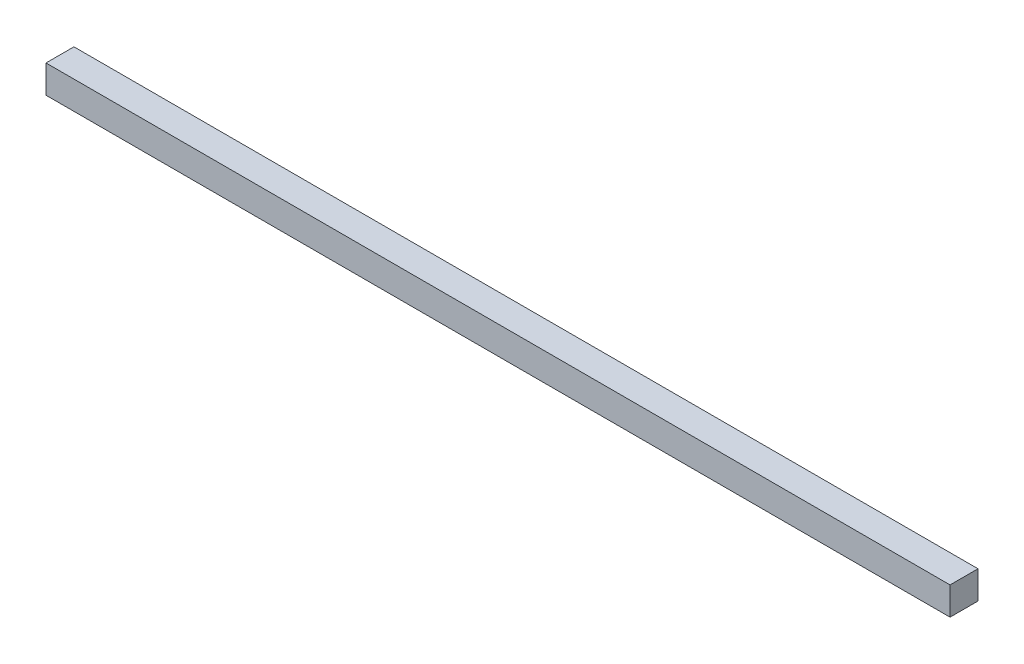
ISO-10303-21;
HEADER;
FILE_DESCRIPTION(('STEP AP214'),'2;1');
FILE_NAME('part.step','',(''),(''),'','','');
FILE_SCHEMA(('AUTOMOTIVE_DESIGN { 1 0 10303 214 1 1 1 1 }'));
ENDSEC;
DATA;
#1=APPLICATION_CONTEXT('core data for automotive mechanical design processes');
#2=APPLICATION_PROTOCOL_DEFINITION('international standard','automotive_design',2000,#1);
#3=PRODUCT_CONTEXT('',#1,'mechanical');
#4=PRODUCT('Part','Part','',(#3));
#5=PRODUCT_RELATED_PRODUCT_CATEGORY('part','',(#4));
#6=PRODUCT_DEFINITION_FORMATION('','',#4);
#7=PRODUCT_DEFINITION_CONTEXT('part definition',#1,'design');
#8=PRODUCT_DEFINITION('design','',#6,#7);
#9=PRODUCT_DEFINITION_SHAPE('','',#8);
#10=(LENGTH_UNIT() NAMED_UNIT(*) SI_UNIT(.MILLI.,.METRE.));
#11=(NAMED_UNIT(*) PLANE_ANGLE_UNIT() SI_UNIT($,.RADIAN.));
#12=(NAMED_UNIT(*) SI_UNIT($,.STERADIAN.) SOLID_ANGLE_UNIT());
#13=UNCERTAINTY_MEASURE_WITH_UNIT(LENGTH_MEASURE(1.E-05),#10,'distance_accuracy_value','');
#14=(GEOMETRIC_REPRESENTATION_CONTEXT(3) GLOBAL_UNCERTAINTY_ASSIGNED_CONTEXT((#13)) GLOBAL_UNIT_ASSIGNED_CONTEXT((#10,
#11,#12)) REPRESENTATION_CONTEXT('',''));
#15=CARTESIAN_POINT('',(0.,0.,0.));
#16=DIRECTION('',(0.,0.,1.));
#17=DIRECTION('',(1.,0.,0.));
#18=AXIS2_PLACEMENT_3D('',#15,#16,#17);
#19=CARTESIAN_POINT('',(-307.975,0.,0.));
#20=DIRECTION('',(0.,-1.,0.));
#21=DIRECTION('',(0.,0.,1.));
#22=AXIS2_PLACEMENT_3D('',#19,#20,#21);
#23=PLANE('',#22);
#24=DIRECTION('',(0.,0.,1.));
#25=VECTOR('',#24,1.);
#26=CARTESIAN_POINT('',(0.,0.,0.));
#27=LINE('',#26,#25);
#28=CARTESIAN_POINT('',(0.,0.,0.));
#29=VERTEX_POINT('',#28);
#30=CARTESIAN_POINT('',(0.,0.,9.525));
#31=VERTEX_POINT('',#30);
#32=EDGE_CURVE('E105',#29,#31,#27,.T.);
#33=ORIENTED_EDGE('',*,*,#32,.T.);
#34=DIRECTION('',(1.,0.,0.));
#35=VECTOR('',#34,1.);
#36=CARTESIAN_POINT('',(-307.975,0.,9.525));
#37=LINE('',#36,#35);
#38=CARTESIAN_POINT('',(-307.975,0.,9.525));
#39=VERTEX_POINT('',#38);
#40=EDGE_CURVE('E44',#39,#31,#37,.T.);
#41=ORIENTED_EDGE('',*,*,#40,.F.);
#42=DIRECTION('',(0.,0.,1.));
#43=VECTOR('',#42,1.);
#44=CARTESIAN_POINT('',(-307.975,0.,0.));
#45=LINE('',#44,#43);
#46=CARTESIAN_POINT('',(-307.975,0.,0.));
#47=VERTEX_POINT('',#46);
#48=EDGE_CURVE('E94',#47,#39,#45,.T.);
#49=ORIENTED_EDGE('',*,*,#48,.F.);
#50=DIRECTION('',(1.,0.,0.));
#51=VECTOR('',#50,1.);
#52=CARTESIAN_POINT('',(-307.975,0.,0.));
#53=LINE('',#52,#51);
#54=EDGE_CURVE('E11',#47,#29,#53,.T.);
#55=ORIENTED_EDGE('',*,*,#54,.T.);
#56=EDGE_LOOP('',(#33,#41,#49,#55));
#57=FACE_BOUND('',#56,.T.);
#58=ADVANCED_FACE('F41',(#57),#23,.T.);
#59=CARTESIAN_POINT('',(-307.975,0.,0.));
#60=DIRECTION('',(0.,0.,1.));
#61=DIRECTION('',(-1.,0.,0.));
#62=AXIS2_PLACEMENT_3D('',#59,#60,#61);
#63=PLANE('',#62);
#64=DIRECTION('',(0.,1.,0.));
#65=VECTOR('',#64,1.);
#66=CARTESIAN_POINT('',(0.,0.,0.));
#67=LINE('',#66,#65);
#68=CARTESIAN_POINT('',(0.,9.525,0.));
#69=VERTEX_POINT('',#68);
#70=EDGE_CURVE('E82',#29,#69,#67,.T.);
#71=ORIENTED_EDGE('',*,*,#70,.F.);
#72=ORIENTED_EDGE('',*,*,#54,.F.);
#73=DIRECTION('',(0.,1.,0.));
#74=VECTOR('',#73,1.);
#75=CARTESIAN_POINT('',(-307.975,0.,0.));
#76=LINE('',#75,#74);
#77=CARTESIAN_POINT('',(-307.975,9.525,0.));
#78=VERTEX_POINT('',#77);
#79=EDGE_CURVE('E59',#47,#78,#76,.T.);
#80=ORIENTED_EDGE('',*,*,#79,.T.);
#81=DIRECTION('',(1.,0.,0.));
#82=VECTOR('',#81,1.);
#83=CARTESIAN_POINT('',(-307.975,9.525,0.));
#84=LINE('',#83,#82);
#85=EDGE_CURVE('E50',#78,#69,#84,.T.);
#86=ORIENTED_EDGE('',*,*,#85,.T.);
#87=EDGE_LOOP('',(#71,#72,#80,#86));
#88=FACE_BOUND('',#87,.T.);
#89=ADVANCED_FACE('F111',(#88),#63,.F.);
#90=CARTESIAN_POINT('',(-307.975,9.525,0.));
#91=DIRECTION('',(0.,-1.,0.));
#92=DIRECTION('',(0.,0.,1.));
#93=AXIS2_PLACEMENT_3D('',#90,#91,#92);
#94=PLANE('',#93);
#95=DIRECTION('',(0.,0.,1.));
#96=VECTOR('',#95,1.);
#97=CARTESIAN_POINT('',(0.,9.525,0.));
#98=LINE('',#97,#96);
#99=CARTESIAN_POINT('',(0.,9.525,9.525));
#100=VERTEX_POINT('',#99);
#101=EDGE_CURVE('E76',#69,#100,#98,.T.);
#102=ORIENTED_EDGE('',*,*,#101,.F.);
#103=ORIENTED_EDGE('',*,*,#85,.F.);
#104=DIRECTION('',(0.,0.,1.));
#105=VECTOR('',#104,1.);
#106=CARTESIAN_POINT('',(-307.975,9.525,0.));
#107=LINE('',#106,#105);
#108=CARTESIAN_POINT('',(-307.975,9.525,9.525));
#109=VERTEX_POINT('',#108);
#110=EDGE_CURVE('E92',#78,#109,#107,.T.);
#111=ORIENTED_EDGE('',*,*,#110,.T.);
#112=DIRECTION('',(1.,0.,0.));
#113=VECTOR('',#112,1.);
#114=CARTESIAN_POINT('',(-307.975,9.525,9.525));
#115=LINE('',#114,#113);
#116=EDGE_CURVE('E97',#109,#100,#115,.T.);
#117=ORIENTED_EDGE('',*,*,#116,.T.);
#118=EDGE_LOOP('',(#102,#103,#111,#117));
#119=FACE_BOUND('',#118,.T.);
#120=ADVANCED_FACE('F100',(#119),#94,.F.);
#121=CARTESIAN_POINT('',(-307.975,0.,9.525));
#122=DIRECTION('',(0.,0.,1.));
#123=DIRECTION('',(-1.,0.,0.));
#124=AXIS2_PLACEMENT_3D('',#121,#122,#123);
#125=PLANE('',#124);
#126=DIRECTION('',(0.,1.,0.));
#127=VECTOR('',#126,1.);
#128=CARTESIAN_POINT('',(0.,0.,9.525));
#129=LINE('',#128,#127);
#130=EDGE_CURVE('E99',#31,#100,#129,.T.);
#131=ORIENTED_EDGE('',*,*,#130,.T.);
#132=ORIENTED_EDGE('',*,*,#116,.F.);
#133=DIRECTION('',(0.,1.,0.));
#134=VECTOR('',#133,1.);
#135=CARTESIAN_POINT('',(-307.975,0.,9.525));
#136=LINE('',#135,#134);
#137=EDGE_CURVE('E89',#39,#109,#136,.T.);
#138=ORIENTED_EDGE('',*,*,#137,.F.);
#139=ORIENTED_EDGE('',*,*,#40,.T.);
#140=EDGE_LOOP('',(#131,#132,#138,#139));
#141=FACE_BOUND('',#140,.T.);
#142=ADVANCED_FACE('F98',(#141),#125,.T.);
#143=CARTESIAN_POINT('',(-307.975,0.,0.));
#144=DIRECTION('',(1.,0.,0.));
#145=DIRECTION('',(0.,0.,1.));
#146=AXIS2_PLACEMENT_3D('',#143,#144,#145);
#147=PLANE('',#146);
#148=ORIENTED_EDGE('',*,*,#48,.T.);
#149=ORIENTED_EDGE('',*,*,#137,.T.);
#150=ORIENTED_EDGE('',*,*,#110,.F.);
#151=ORIENTED_EDGE('',*,*,#79,.F.);
#152=EDGE_LOOP('',(#148,#149,#150,#151));
#153=FACE_BOUND('',#152,.T.);
#154=ADVANCED_FACE('F90',(#153),#147,.F.);
#155=CARTESIAN_POINT('',(0.,0.,0.));
#156=DIRECTION('',(1.,0.,0.));
#157=DIRECTION('',(0.,0.,1.));
#158=AXIS2_PLACEMENT_3D('',#155,#156,#157);
#159=PLANE('',#158);
#160=ORIENTED_EDGE('',*,*,#32,.F.);
#161=ORIENTED_EDGE('',*,*,#70,.T.);
#162=ORIENTED_EDGE('',*,*,#101,.T.);
#163=ORIENTED_EDGE('',*,*,#130,.F.);
#164=EDGE_LOOP('',(#160,#161,#162,#163));
#165=FACE_BOUND('',#164,.T.);
#166=ADVANCED_FACE('F114',(#165),#159,.T.);
#167=CLOSED_SHELL('',(#58,#89,#120,#142,#154,#166));
#168=MANIFOLD_SOLID_BREP('B2',#167);
#169=ADVANCED_BREP_SHAPE_REPRESENTATION('',(#18,#168),#14);
#170=SHAPE_DEFINITION_REPRESENTATION(#9,#169);
ENDSEC;
END-ISO-10303-21;
